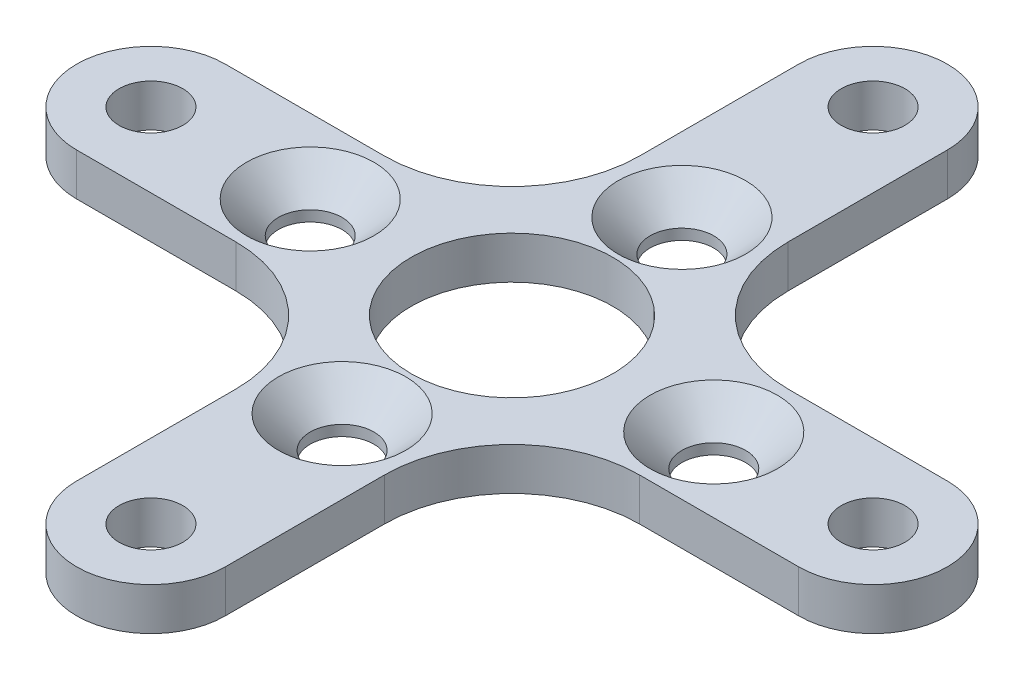
ISO-10303-21;
HEADER;
FILE_DESCRIPTION(('STEP AP214'),'2;1');
FILE_NAME('part.step','',(''),(''),'','','');
FILE_SCHEMA(('AUTOMOTIVE_DESIGN { 1 0 10303 214 1 1 1 1 }'));
ENDSEC;
DATA;
#1=APPLICATION_CONTEXT('core data for automotive mechanical design processes');
#2=APPLICATION_PROTOCOL_DEFINITION('international standard','automotive_design',2000,#1);
#3=PRODUCT_CONTEXT('',#1,'mechanical');
#4=PRODUCT('Part','Part','',(#3));
#5=PRODUCT_RELATED_PRODUCT_CATEGORY('part','',(#4));
#6=PRODUCT_DEFINITION_FORMATION('','',#4);
#7=PRODUCT_DEFINITION_CONTEXT('part definition',#1,'design');
#8=PRODUCT_DEFINITION('design','',#6,#7);
#9=PRODUCT_DEFINITION_SHAPE('','',#8);
#10=(LENGTH_UNIT() NAMED_UNIT(*) SI_UNIT(.MILLI.,.METRE.));
#11=(NAMED_UNIT(*) PLANE_ANGLE_UNIT() SI_UNIT($,.RADIAN.));
#12=(NAMED_UNIT(*) SI_UNIT($,.STERADIAN.) SOLID_ANGLE_UNIT());
#13=UNCERTAINTY_MEASURE_WITH_UNIT(LENGTH_MEASURE(1.E-05),#10,'distance_accuracy_value','');
#14=(GEOMETRIC_REPRESENTATION_CONTEXT(3) GLOBAL_UNCERTAINTY_ASSIGNED_CONTEXT((#13)) GLOBAL_UNIT_ASSIGNED_CONTEXT((#10,
#11,#12)) REPRESENTATION_CONTEXT('',''));
#15=CARTESIAN_POINT('',(0.,0.,0.));
#16=DIRECTION('',(0.,0.,1.));
#17=DIRECTION('',(1.,0.,0.));
#18=AXIS2_PLACEMENT_3D('',#15,#16,#17);
#19=CARTESIAN_POINT('',(0.,2.,17.));
#20=DIRECTION('',(0.,-1.,0.));
#21=DIRECTION('',(0.,0.,-1.));
#22=AXIS2_PLACEMENT_3D('',#19,#20,#21);
#23=PLANE('',#22);
#24=CARTESIAN_POINT('',(-9.5,2.,0.));
#25=DIRECTION('',(0.,-1.,0.));
#26=DIRECTION('',(0.,0.,-1.));
#27=AXIS2_PLACEMENT_3D('',#24,#25,#26);
#28=CIRCLE('',#27,3.);
#29=CARTESIAN_POINT('',(-9.5,2.,-3.));
#30=VERTEX_POINT('',#29);
#31=EDGE_CURVE('E272',#30,#30,#28,.T.);
#32=ORIENTED_EDGE('',*,*,#31,.T.);
#33=EDGE_LOOP('',(#32));
#34=FACE_BOUND('',#33,.T.);
#35=CARTESIAN_POINT('',(0.,2.,8.));
#36=DIRECTION('',(0.,-1.,0.));
#37=DIRECTION('',(0.,0.,-1.));
#38=AXIS2_PLACEMENT_3D('',#35,#36,#37);
#39=CIRCLE('',#38,3.00000000000001);
#40=CARTESIAN_POINT('',(0.,2.,4.99999999999999));
#41=VERTEX_POINT('',#40);
#42=EDGE_CURVE('E269',#41,#41,#39,.T.);
#43=ORIENTED_EDGE('',*,*,#42,.T.);
#44=EDGE_LOOP('',(#43));
#45=FACE_BOUND('',#44,.T.);
#46=CARTESIAN_POINT('',(9.5,2.,0.));
#47=DIRECTION('',(0.,-1.,0.));
#48=DIRECTION('',(0.,0.,-1.));
#49=AXIS2_PLACEMENT_3D('',#46,#47,#48);
#50=CIRCLE('',#49,3.00000000000002);
#51=CARTESIAN_POINT('',(9.5,2.,-3.00000000000002));
#52=VERTEX_POINT('',#51);
#53=EDGE_CURVE('E266',#52,#52,#50,.T.);
#54=ORIENTED_EDGE('',*,*,#53,.T.);
#55=EDGE_LOOP('',(#54));
#56=FACE_BOUND('',#55,.T.);
#57=CARTESIAN_POINT('',(0.,2.,-8.));
#58=DIRECTION('',(0.,-1.,0.));
#59=DIRECTION('',(0.,0.,-1.));
#60=AXIS2_PLACEMENT_3D('',#57,#58,#59);
#61=CIRCLE('',#60,3.);
#62=CARTESIAN_POINT('',(0.,2.,-11.));
#63=VERTEX_POINT('',#62);
#64=EDGE_CURVE('E263',#63,#63,#61,.T.);
#65=ORIENTED_EDGE('',*,*,#64,.T.);
#66=EDGE_LOOP('',(#65));
#67=FACE_BOUND('',#66,.T.);
#68=CARTESIAN_POINT('',(0.,2.,17.));
#69=DIRECTION('',(0.,1.,0.));
#70=DIRECTION('',(0.,0.,-1.));
#71=AXIS2_PLACEMENT_3D('',#68,#69,#70);
#72=CIRCLE('',#71,3.5);
#73=CARTESIAN_POINT('',(-3.5,2.,17.));
#74=VERTEX_POINT('',#73);
#75=CARTESIAN_POINT('',(3.5,2.,17.));
#76=VERTEX_POINT('',#75);
#77=EDGE_CURVE('E221',#74,#76,#72,.T.);
#78=ORIENTED_EDGE('',*,*,#77,.T.);
#79=DIRECTION('',(0.,0.,-1.));
#80=VECTOR('',#79,1.);
#81=CARTESIAN_POINT('',(3.5,2.,9.49999999999999));
#82=LINE('',#81,#80);
#83=CARTESIAN_POINT('',(3.5,2.,9.49999999999999));
#84=VERTEX_POINT('',#83);
#85=EDGE_CURVE('E129',#76,#84,#82,.T.);
#86=ORIENTED_EDGE('',*,*,#85,.T.);
#87=CARTESIAN_POINT('',(9.5,2.,9.49999999999999));
#88=DIRECTION('',(0.,-1.,0.));
#89=DIRECTION('',(0.,0.,1.));
#90=AXIS2_PLACEMENT_3D('',#87,#88,#89);
#91=CIRCLE('',#90,6.);
#92=CARTESIAN_POINT('',(9.5,2.,3.5));
#93=VERTEX_POINT('',#92);
#94=EDGE_CURVE('E440',#84,#93,#91,.T.);
#95=ORIENTED_EDGE('',*,*,#94,.T.);
#96=DIRECTION('',(1.,0.,0.));
#97=VECTOR('',#96,1.);
#98=CARTESIAN_POINT('',(17.,2.,3.49999999999999));
#99=LINE('',#98,#97);
#100=CARTESIAN_POINT('',(17.,2.,3.49999999999999));
#101=VERTEX_POINT('',#100);
#102=EDGE_CURVE('E442',#93,#101,#99,.T.);
#103=ORIENTED_EDGE('',*,*,#102,.T.);
#104=CARTESIAN_POINT('',(17.,2.,0.));
#105=DIRECTION('',(0.,1.,0.));
#106=DIRECTION('',(0.,0.,-1.));
#107=AXIS2_PLACEMENT_3D('',#104,#105,#106);
#108=CIRCLE('',#107,3.5);
#109=CARTESIAN_POINT('',(17.,2.,-3.5));
#110=VERTEX_POINT('',#109);
#111=EDGE_CURVE('E444',#101,#110,#108,.T.);
#112=ORIENTED_EDGE('',*,*,#111,.T.);
#113=DIRECTION('',(-1.,0.,0.));
#114=VECTOR('',#113,1.);
#115=CARTESIAN_POINT('',(17.,2.,-3.5));
#116=LINE('',#115,#114);
#117=CARTESIAN_POINT('',(9.5,2.,-3.5));
#118=VERTEX_POINT('',#117);
#119=EDGE_CURVE('E446',#110,#118,#116,.T.);
#120=ORIENTED_EDGE('',*,*,#119,.T.);
#121=CARTESIAN_POINT('',(9.5,2.,-9.5));
#122=DIRECTION('',(0.,-1.,0.));
#123=DIRECTION('',(0.,0.,-1.));
#124=AXIS2_PLACEMENT_3D('',#121,#122,#123);
#125=CIRCLE('',#124,6.);
#126=CARTESIAN_POINT('',(3.5,2.,-9.5));
#127=VERTEX_POINT('',#126);
#128=EDGE_CURVE('E448',#118,#127,#125,.T.);
#129=ORIENTED_EDGE('',*,*,#128,.T.);
#130=DIRECTION('',(0.,0.,-1.));
#131=VECTOR('',#130,1.);
#132=CARTESIAN_POINT('',(3.5,2.,-17.));
#133=LINE('',#132,#131);
#134=CARTESIAN_POINT('',(3.5,2.,-17.));
#135=VERTEX_POINT('',#134);
#136=EDGE_CURVE('E450',#127,#135,#133,.T.);
#137=ORIENTED_EDGE('',*,*,#136,.T.);
#138=CARTESIAN_POINT('',(0.,2.,-17.));
#139=DIRECTION('',(0.,1.,0.));
#140=DIRECTION('',(0.,0.,-1.));
#141=AXIS2_PLACEMENT_3D('',#138,#139,#140);
#142=CIRCLE('',#141,3.5);
#143=CARTESIAN_POINT('',(-3.50000000000001,2.,-17.));
#144=VERTEX_POINT('',#143);
#145=EDGE_CURVE('E452',#135,#144,#142,.T.);
#146=ORIENTED_EDGE('',*,*,#145,.T.);
#147=DIRECTION('',(0.,0.,1.));
#148=VECTOR('',#147,1.);
#149=CARTESIAN_POINT('',(-3.50000000000001,2.,-9.5));
#150=LINE('',#149,#148);
#151=CARTESIAN_POINT('',(-3.50000000000001,2.,-9.5));
#152=VERTEX_POINT('',#151);
#153=EDGE_CURVE('E454',#144,#152,#150,.T.);
#154=ORIENTED_EDGE('',*,*,#153,.T.);
#155=CARTESIAN_POINT('',(-9.5,2.,-9.5));
#156=DIRECTION('',(0.,-1.,0.));
#157=DIRECTION('',(0.,0.,1.));
#158=AXIS2_PLACEMENT_3D('',#155,#156,#157);
#159=CIRCLE('',#158,6.);
#160=CARTESIAN_POINT('',(-9.5,2.,-3.5));
#161=VERTEX_POINT('',#160);
#162=EDGE_CURVE('E456',#152,#161,#159,.T.);
#163=ORIENTED_EDGE('',*,*,#162,.T.);
#164=DIRECTION('',(-1.,0.,0.));
#165=VECTOR('',#164,1.);
#166=CARTESIAN_POINT('',(-17.,2.,-3.49999999999999));
#167=LINE('',#166,#165);
#168=CARTESIAN_POINT('',(-17.,2.,-3.49999999999999));
#169=VERTEX_POINT('',#168);
#170=EDGE_CURVE('E458',#161,#169,#167,.T.);
#171=ORIENTED_EDGE('',*,*,#170,.T.);
#172=CARTESIAN_POINT('',(-17.,2.,0.));
#173=DIRECTION('',(0.,1.,0.));
#174=DIRECTION('',(0.,0.,-1.));
#175=AXIS2_PLACEMENT_3D('',#172,#173,#174);
#176=CIRCLE('',#175,3.5);
#177=CARTESIAN_POINT('',(-17.,2.,3.5));
#178=VERTEX_POINT('',#177);
#179=EDGE_CURVE('E172',#169,#178,#176,.T.);
#180=ORIENTED_EDGE('',*,*,#179,.T.);
#181=DIRECTION('',(1.,0.,0.));
#182=VECTOR('',#181,1.);
#183=CARTESIAN_POINT('',(-9.5,2.,3.5));
#184=LINE('',#183,#182);
#185=CARTESIAN_POINT('',(-9.5,2.,3.5));
#186=VERTEX_POINT('',#185);
#187=EDGE_CURVE('E166',#178,#186,#184,.T.);
#188=ORIENTED_EDGE('',*,*,#187,.T.);
#189=CARTESIAN_POINT('',(-9.5,2.,9.5));
#190=DIRECTION('',(0.,-1.,0.));
#191=DIRECTION('',(0.,0.,1.));
#192=AXIS2_PLACEMENT_3D('',#189,#190,#191);
#193=CIRCLE('',#192,6.);
#194=CARTESIAN_POINT('',(-3.5,2.,9.5));
#195=VERTEX_POINT('',#194);
#196=EDGE_CURVE('E170',#186,#195,#193,.T.);
#197=ORIENTED_EDGE('',*,*,#196,.T.);
#198=DIRECTION('',(0.,0.,1.));
#199=VECTOR('',#198,1.);
#200=CARTESIAN_POINT('',(-3.5,2.,17.));
#201=LINE('',#200,#199);
#202=EDGE_CURVE('E61',#195,#74,#201,.T.);
#203=ORIENTED_EDGE('',*,*,#202,.T.);
#204=EDGE_LOOP('',(#78,#86,#95,#103,#112,#120,#129,#137,#146,#154,#163,#171,#180,#188,#197,#203));
#205=FACE_BOUND('',#204,.T.);
#206=CARTESIAN_POINT('',(0.,2.,0.));
#207=DIRECTION('',(0.,1.,0.));
#208=DIRECTION('',(0.,0.,1.));
#209=AXIS2_PLACEMENT_3D('',#206,#207,#208);
#210=CIRCLE('',#209,4.75);
#211=CARTESIAN_POINT('',(0.,2.,4.75));
#212=VERTEX_POINT('',#211);
#213=EDGE_CURVE('E194',#212,#212,#210,.T.);
#214=ORIENTED_EDGE('',*,*,#213,.F.);
#215=EDGE_LOOP('',(#214));
#216=FACE_BOUND('',#215,.T.);
#217=CARTESIAN_POINT('',(0.,2.,-17.));
#218=DIRECTION('',(0.,1.,0.));
#219=DIRECTION('',(0.,0.,1.));
#220=AXIS2_PLACEMENT_3D('',#217,#218,#219);
#221=CIRCLE('',#220,1.5);
#222=CARTESIAN_POINT('',(0.,2.,-15.5));
#223=VERTEX_POINT('',#222);
#224=EDGE_CURVE('E428',#223,#223,#221,.T.);
#225=ORIENTED_EDGE('',*,*,#224,.F.);
#226=EDGE_LOOP('',(#225));
#227=FACE_BOUND('',#226,.T.);
#228=CARTESIAN_POINT('',(17.,2.,0.));
#229=DIRECTION('',(0.,1.,0.));
#230=DIRECTION('',(0.,0.,1.));
#231=AXIS2_PLACEMENT_3D('',#228,#229,#230);
#232=CIRCLE('',#231,1.5);
#233=CARTESIAN_POINT('',(17.,2.,1.5));
#234=VERTEX_POINT('',#233);
#235=EDGE_CURVE('E419',#234,#234,#232,.T.);
#236=ORIENTED_EDGE('',*,*,#235,.F.);
#237=EDGE_LOOP('',(#236));
#238=FACE_BOUND('',#237,.T.);
#239=CARTESIAN_POINT('',(0.,2.,17.));
#240=DIRECTION('',(0.,1.,0.));
#241=DIRECTION('',(0.,0.,1.));
#242=AXIS2_PLACEMENT_3D('',#239,#240,#241);
#243=CIRCLE('',#242,1.5);
#244=CARTESIAN_POINT('',(0.,2.,18.5));
#245=VERTEX_POINT('',#244);
#246=EDGE_CURVE('E410',#245,#245,#243,.T.);
#247=ORIENTED_EDGE('',*,*,#246,.F.);
#248=EDGE_LOOP('',(#247));
#249=FACE_BOUND('',#248,.T.);
#250=CARTESIAN_POINT('',(-17.,2.,0.));
#251=DIRECTION('',(0.,1.,0.));
#252=DIRECTION('',(0.,0.,1.));
#253=AXIS2_PLACEMENT_3D('',#250,#251,#252);
#254=CIRCLE('',#253,1.5);
#255=CARTESIAN_POINT('',(-17.,2.,1.5));
#256=VERTEX_POINT('',#255);
#257=EDGE_CURVE('E401',#256,#256,#254,.T.);
#258=ORIENTED_EDGE('',*,*,#257,.F.);
#259=EDGE_LOOP('',(#258));
#260=FACE_BOUND('',#259,.T.);
#261=ADVANCED_FACE('F43',(#34,#45,#56,#67,#205,#216,#227,#238,#249,#260),#23,.F.);
#262=CARTESIAN_POINT('',(0.,0.,17.));
#263=DIRECTION('',(0.,-1.,0.));
#264=DIRECTION('',(0.,0.,-1.));
#265=AXIS2_PLACEMENT_3D('',#262,#263,#264);
#266=PLANE('',#265);
#267=CARTESIAN_POINT('',(-17.,0.,0.));
#268=DIRECTION('',(0.,1.,0.));
#269=DIRECTION('',(0.,0.,1.));
#270=AXIS2_PLACEMENT_3D('',#267,#268,#269);
#271=CIRCLE('',#270,1.5);
#272=CARTESIAN_POINT('',(-17.,0.,1.5));
#273=VERTEX_POINT('',#272);
#274=EDGE_CURVE('E398',#273,#273,#271,.T.);
#275=ORIENTED_EDGE('',*,*,#274,.T.);
#276=EDGE_LOOP('',(#275));
#277=FACE_BOUND('',#276,.T.);
#278=CARTESIAN_POINT('',(0.,0.,17.));
#279=DIRECTION('',(0.,1.,0.));
#280=DIRECTION('',(0.,0.,1.));
#281=AXIS2_PLACEMENT_3D('',#278,#279,#280);
#282=CIRCLE('',#281,1.5);
#283=CARTESIAN_POINT('',(0.,0.,18.5));
#284=VERTEX_POINT('',#283);
#285=EDGE_CURVE('E409',#284,#284,#282,.T.);
#286=ORIENTED_EDGE('',*,*,#285,.T.);
#287=EDGE_LOOP('',(#286));
#288=FACE_BOUND('',#287,.T.);
#289=CARTESIAN_POINT('',(17.,0.,0.));
#290=DIRECTION('',(0.,1.,0.));
#291=DIRECTION('',(0.,0.,1.));
#292=AXIS2_PLACEMENT_3D('',#289,#290,#291);
#293=CIRCLE('',#292,1.5);
#294=CARTESIAN_POINT('',(17.,0.,1.5));
#295=VERTEX_POINT('',#294);
#296=EDGE_CURVE('E418',#295,#295,#293,.T.);
#297=ORIENTED_EDGE('',*,*,#296,.T.);
#298=EDGE_LOOP('',(#297));
#299=FACE_BOUND('',#298,.T.);
#300=CARTESIAN_POINT('',(0.,0.,-17.));
#301=DIRECTION('',(0.,1.,0.));
#302=DIRECTION('',(0.,0.,1.));
#303=AXIS2_PLACEMENT_3D('',#300,#301,#302);
#304=CIRCLE('',#303,1.5);
#305=CARTESIAN_POINT('',(0.,0.,-15.5));
#306=VERTEX_POINT('',#305);
#307=EDGE_CURVE('E427',#306,#306,#304,.T.);
#308=ORIENTED_EDGE('',*,*,#307,.T.);
#309=EDGE_LOOP('',(#308));
#310=FACE_BOUND('',#309,.T.);
#311=CARTESIAN_POINT('',(0.,0.,17.));
#312=DIRECTION('',(0.,1.,0.));
#313=DIRECTION('',(0.,0.,-1.));
#314=AXIS2_PLACEMENT_3D('',#311,#312,#313);
#315=CIRCLE('',#314,3.5);
#316=CARTESIAN_POINT('',(-3.5,0.,17.));
#317=VERTEX_POINT('',#316);
#318=CARTESIAN_POINT('',(3.5,0.,17.));
#319=VERTEX_POINT('',#318);
#320=EDGE_CURVE('E190',#317,#319,#315,.T.);
#321=ORIENTED_EDGE('',*,*,#320,.F.);
#322=DIRECTION('',(0.,0.,1.));
#323=VECTOR('',#322,1.);
#324=CARTESIAN_POINT('',(-3.5,0.,17.));
#325=LINE('',#324,#323);
#326=CARTESIAN_POINT('',(-3.5,0.,9.5));
#327=VERTEX_POINT('',#326);
#328=EDGE_CURVE('E120',#327,#317,#325,.T.);
#329=ORIENTED_EDGE('',*,*,#328,.F.);
#330=CARTESIAN_POINT('',(-9.5,0.,9.5));
#331=DIRECTION('',(0.,-1.,0.));
#332=DIRECTION('',(0.,0.,1.));
#333=AXIS2_PLACEMENT_3D('',#330,#331,#332);
#334=CIRCLE('',#333,6.);
#335=CARTESIAN_POINT('',(-9.5,0.,3.5));
#336=VERTEX_POINT('',#335);
#337=EDGE_CURVE('E114',#336,#327,#334,.T.);
#338=ORIENTED_EDGE('',*,*,#337,.F.);
#339=DIRECTION('',(1.,0.,0.));
#340=VECTOR('',#339,1.);
#341=CARTESIAN_POINT('',(-9.5,0.,3.5));
#342=LINE('',#341,#340);
#343=CARTESIAN_POINT('',(-17.,0.,3.5));
#344=VERTEX_POINT('',#343);
#345=EDGE_CURVE('E180',#344,#336,#342,.T.);
#346=ORIENTED_EDGE('',*,*,#345,.F.);
#347=CARTESIAN_POINT('',(-17.,0.,0.));
#348=DIRECTION('',(0.,1.,0.));
#349=DIRECTION('',(0.,0.,-1.));
#350=AXIS2_PLACEMENT_3D('',#347,#348,#349);
#351=CIRCLE('',#350,3.5);
#352=CARTESIAN_POINT('',(-17.,0.,-3.49999999999999));
#353=VERTEX_POINT('',#352);
#354=EDGE_CURVE('E216',#353,#344,#351,.T.);
#355=ORIENTED_EDGE('',*,*,#354,.F.);
#356=DIRECTION('',(-1.,0.,0.));
#357=VECTOR('',#356,1.);
#358=CARTESIAN_POINT('',(-17.,0.,-3.49999999999999));
#359=LINE('',#358,#357);
#360=CARTESIAN_POINT('',(-9.5,0.,-3.5));
#361=VERTEX_POINT('',#360);
#362=EDGE_CURVE('E214',#361,#353,#359,.T.);
#363=ORIENTED_EDGE('',*,*,#362,.F.);
#364=CARTESIAN_POINT('',(-9.5,0.,-9.5));
#365=DIRECTION('',(0.,-1.,0.));
#366=DIRECTION('',(0.,0.,1.));
#367=AXIS2_PLACEMENT_3D('',#364,#365,#366);
#368=CIRCLE('',#367,6.);
#369=CARTESIAN_POINT('',(-3.50000000000001,0.,-9.5));
#370=VERTEX_POINT('',#369);
#371=EDGE_CURVE('E212',#370,#361,#368,.T.);
#372=ORIENTED_EDGE('',*,*,#371,.F.);
#373=DIRECTION('',(0.,0.,1.));
#374=VECTOR('',#373,1.);
#375=CARTESIAN_POINT('',(-3.50000000000001,0.,-9.5));
#376=LINE('',#375,#374);
#377=CARTESIAN_POINT('',(-3.50000000000001,0.,-17.));
#378=VERTEX_POINT('',#377);
#379=EDGE_CURVE('E210',#378,#370,#376,.T.);
#380=ORIENTED_EDGE('',*,*,#379,.F.);
#381=CARTESIAN_POINT('',(0.,0.,-17.));
#382=DIRECTION('',(0.,1.,0.));
#383=DIRECTION('',(0.,0.,-1.));
#384=AXIS2_PLACEMENT_3D('',#381,#382,#383);
#385=CIRCLE('',#384,3.5);
#386=CARTESIAN_POINT('',(3.5,0.,-17.));
#387=VERTEX_POINT('',#386);
#388=EDGE_CURVE('E208',#387,#378,#385,.T.);
#389=ORIENTED_EDGE('',*,*,#388,.F.);
#390=DIRECTION('',(0.,0.,-1.));
#391=VECTOR('',#390,1.);
#392=CARTESIAN_POINT('',(3.5,0.,-17.));
#393=LINE('',#392,#391);
#394=CARTESIAN_POINT('',(3.5,0.,-9.5));
#395=VERTEX_POINT('',#394);
#396=EDGE_CURVE('E206',#395,#387,#393,.T.);
#397=ORIENTED_EDGE('',*,*,#396,.F.);
#398=CARTESIAN_POINT('',(9.5,0.,-9.5));
#399=DIRECTION('',(0.,-1.,0.));
#400=DIRECTION('',(0.,0.,-1.));
#401=AXIS2_PLACEMENT_3D('',#398,#399,#400);
#402=CIRCLE('',#401,6.);
#403=CARTESIAN_POINT('',(9.5,0.,-3.5));
#404=VERTEX_POINT('',#403);
#405=EDGE_CURVE('E204',#404,#395,#402,.T.);
#406=ORIENTED_EDGE('',*,*,#405,.F.);
#407=DIRECTION('',(-1.,0.,0.));
#408=VECTOR('',#407,1.);
#409=CARTESIAN_POINT('',(17.,0.,-3.5));
#410=LINE('',#409,#408);
#411=CARTESIAN_POINT('',(17.,0.,-3.5));
#412=VERTEX_POINT('',#411);
#413=EDGE_CURVE('E202',#412,#404,#410,.T.);
#414=ORIENTED_EDGE('',*,*,#413,.F.);
#415=CARTESIAN_POINT('',(17.,0.,0.));
#416=DIRECTION('',(0.,1.,0.));
#417=DIRECTION('',(0.,0.,-1.));
#418=AXIS2_PLACEMENT_3D('',#415,#416,#417);
#419=CIRCLE('',#418,3.5);
#420=CARTESIAN_POINT('',(17.,0.,3.49999999999999));
#421=VERTEX_POINT('',#420);
#422=EDGE_CURVE('E200',#421,#412,#419,.T.);
#423=ORIENTED_EDGE('',*,*,#422,.F.);
#424=DIRECTION('',(1.,0.,0.));
#425=VECTOR('',#424,1.);
#426=CARTESIAN_POINT('',(17.,0.,3.49999999999999));
#427=LINE('',#426,#425);
#428=CARTESIAN_POINT('',(9.5,0.,3.5));
#429=VERTEX_POINT('',#428);
#430=EDGE_CURVE('E198',#429,#421,#427,.T.);
#431=ORIENTED_EDGE('',*,*,#430,.F.);
#432=CARTESIAN_POINT('',(9.5,0.,9.49999999999999));
#433=DIRECTION('',(0.,-1.,0.));
#434=DIRECTION('',(0.,0.,1.));
#435=AXIS2_PLACEMENT_3D('',#432,#433,#434);
#436=CIRCLE('',#435,6.);
#437=CARTESIAN_POINT('',(3.5,0.,9.49999999999999));
#438=VERTEX_POINT('',#437);
#439=EDGE_CURVE('E196',#438,#429,#436,.T.);
#440=ORIENTED_EDGE('',*,*,#439,.F.);
#441=DIRECTION('',(0.,0.,-1.));
#442=VECTOR('',#441,1.);
#443=CARTESIAN_POINT('',(3.5,0.,9.49999999999999));
#444=LINE('',#443,#442);
#445=EDGE_CURVE('E193',#319,#438,#444,.T.);
#446=ORIENTED_EDGE('',*,*,#445,.F.);
#447=EDGE_LOOP('',(#321,#329,#338,#346,#355,#363,#372,#380,#389,#397,#406,#414,#423,#431,#440,#446));
#448=FACE_BOUND('',#447,.T.);
#449=CARTESIAN_POINT('',(0.,0.,0.));
#450=DIRECTION('',(0.,1.,0.));
#451=DIRECTION('',(0.,0.,1.));
#452=AXIS2_PLACEMENT_3D('',#449,#450,#451);
#453=CIRCLE('',#452,4.75);
#454=CARTESIAN_POINT('',(0.,0.,4.75));
#455=VERTEX_POINT('',#454);
#456=EDGE_CURVE('E431',#455,#455,#453,.T.);
#457=ORIENTED_EDGE('',*,*,#456,.T.);
#458=EDGE_LOOP('',(#457));
#459=FACE_BOUND('',#458,.T.);
#460=CARTESIAN_POINT('',(0.,0.,-8.));
#461=DIRECTION('',(0.,1.,0.));
#462=DIRECTION('',(0.,0.,1.));
#463=AXIS2_PLACEMENT_3D('',#460,#461,#462);
#464=CIRCLE('',#463,1.5);
#465=CARTESIAN_POINT('',(0.,0.,-6.5));
#466=VERTEX_POINT('',#465);
#467=EDGE_CURVE('E422',#466,#466,#464,.T.);
#468=ORIENTED_EDGE('',*,*,#467,.T.);
#469=EDGE_LOOP('',(#468));
#470=FACE_BOUND('',#469,.T.);
#471=CARTESIAN_POINT('',(9.5,0.,0.));
#472=DIRECTION('',(0.,1.,0.));
#473=DIRECTION('',(0.,0.,1.));
#474=AXIS2_PLACEMENT_3D('',#471,#472,#473);
#475=CIRCLE('',#474,1.5);
#476=CARTESIAN_POINT('',(9.5,0.,1.5));
#477=VERTEX_POINT('',#476);
#478=EDGE_CURVE('E413',#477,#477,#475,.T.);
#479=ORIENTED_EDGE('',*,*,#478,.T.);
#480=EDGE_LOOP('',(#479));
#481=FACE_BOUND('',#480,.T.);
#482=CARTESIAN_POINT('',(0.,0.,8.));
#483=DIRECTION('',(0.,1.,0.));
#484=DIRECTION('',(0.,0.,1.));
#485=AXIS2_PLACEMENT_3D('',#482,#483,#484);
#486=CIRCLE('',#485,1.5);
#487=CARTESIAN_POINT('',(0.,0.,9.5));
#488=VERTEX_POINT('',#487);
#489=EDGE_CURVE('E405',#488,#488,#486,.T.);
#490=ORIENTED_EDGE('',*,*,#489,.T.);
#491=EDGE_LOOP('',(#490));
#492=FACE_BOUND('',#491,.T.);
#493=CARTESIAN_POINT('',(-9.5,0.,0.));
#494=DIRECTION('',(0.,1.,0.));
#495=DIRECTION('',(0.,0.,1.));
#496=AXIS2_PLACEMENT_3D('',#493,#494,#495);
#497=CIRCLE('',#496,1.5);
#498=CARTESIAN_POINT('',(-9.5,0.,1.5));
#499=VERTEX_POINT('',#498);
#500=EDGE_CURVE('E396',#499,#499,#497,.T.);
#501=ORIENTED_EDGE('',*,*,#500,.T.);
#502=EDGE_LOOP('',(#501));
#503=FACE_BOUND('',#502,.T.);
#504=ADVANCED_FACE('F298',(#277,#288,#299,#310,#448,#459,#470,#481,#492,#503),#266,.T.);
#505=CARTESIAN_POINT('',(0.,2.,17.));
#506=DIRECTION('',(0.,-1.,0.));
#507=DIRECTION('',(0.,0.,-1.));
#508=AXIS2_PLACEMENT_3D('',#505,#506,#507);
#509=CYLINDRICAL_SURFACE('',#508,3.5);
#510=ORIENTED_EDGE('',*,*,#320,.T.);
#511=DIRECTION('',(0.,-1.,0.));
#512=VECTOR('',#511,1.);
#513=CARTESIAN_POINT('',(3.5,2.,17.));
#514=LINE('',#513,#512);
#515=EDGE_CURVE('E258',#76,#319,#514,.T.);
#516=ORIENTED_EDGE('',*,*,#515,.F.);
#517=ORIENTED_EDGE('',*,*,#77,.F.);
#518=DIRECTION('',(0.,-1.,0.));
#519=VECTOR('',#518,1.);
#520=CARTESIAN_POINT('',(-3.5,2.,17.));
#521=LINE('',#520,#519);
#522=EDGE_CURVE('E186',#74,#317,#521,.T.);
#523=ORIENTED_EDGE('',*,*,#522,.T.);
#524=EDGE_LOOP('',(#510,#516,#517,#523));
#525=FACE_BOUND('',#524,.T.);
#526=ADVANCED_FACE('F306',(#525),#509,.T.);
#527=CARTESIAN_POINT('',(3.5,2.,9.49999999999999));
#528=DIRECTION('',(-1.,0.,0.));
#529=DIRECTION('',(0.,0.,1.));
#530=AXIS2_PLACEMENT_3D('',#527,#528,#529);
#531=PLANE('',#530);
#532=ORIENTED_EDGE('',*,*,#445,.T.);
#533=DIRECTION('',(0.,-1.,0.));
#534=VECTOR('',#533,1.);
#535=CARTESIAN_POINT('',(3.5,2.,9.49999999999999));
#536=LINE('',#535,#534);
#537=EDGE_CURVE('E255',#84,#438,#536,.T.);
#538=ORIENTED_EDGE('',*,*,#537,.F.);
#539=ORIENTED_EDGE('',*,*,#85,.F.);
#540=ORIENTED_EDGE('',*,*,#515,.T.);
#541=EDGE_LOOP('',(#532,#538,#539,#540));
#542=FACE_BOUND('',#541,.T.);
#543=ADVANCED_FACE('F364',(#542),#531,.F.);
#544=CARTESIAN_POINT('',(9.5,2.,9.49999999999999));
#545=DIRECTION('',(0.,-1.,0.));
#546=DIRECTION('',(0.,0.,-1.));
#547=AXIS2_PLACEMENT_3D('',#544,#545,#546);
#548=CYLINDRICAL_SURFACE('',#547,6.);
#549=ORIENTED_EDGE('',*,*,#439,.T.);
#550=DIRECTION('',(0.,-1.,0.));
#551=VECTOR('',#550,1.);
#552=CARTESIAN_POINT('',(9.5,2.,3.5));
#553=LINE('',#552,#551);
#554=EDGE_CURVE('E252',#93,#429,#553,.T.);
#555=ORIENTED_EDGE('',*,*,#554,.F.);
#556=ORIENTED_EDGE('',*,*,#94,.F.);
#557=ORIENTED_EDGE('',*,*,#537,.T.);
#558=EDGE_LOOP('',(#549,#555,#556,#557));
#559=FACE_BOUND('',#558,.T.);
#560=ADVANCED_FACE('F360',(#559),#548,.F.);
#561=CARTESIAN_POINT('',(17.,2.,3.49999999999999));
#562=DIRECTION('',(0.,0.,-1.));
#563=DIRECTION('',(-1.,0.,0.));
#564=AXIS2_PLACEMENT_3D('',#561,#562,#563);
#565=PLANE('',#564);
#566=ORIENTED_EDGE('',*,*,#430,.T.);
#567=DIRECTION('',(0.,-1.,0.));
#568=VECTOR('',#567,1.);
#569=CARTESIAN_POINT('',(17.,2.,3.49999999999999));
#570=LINE('',#569,#568);
#571=EDGE_CURVE('E249',#101,#421,#570,.T.);
#572=ORIENTED_EDGE('',*,*,#571,.F.);
#573=ORIENTED_EDGE('',*,*,#102,.F.);
#574=ORIENTED_EDGE('',*,*,#554,.T.);
#575=EDGE_LOOP('',(#566,#572,#573,#574));
#576=FACE_BOUND('',#575,.T.);
#577=ADVANCED_FACE('F356',(#576),#565,.F.);
#578=CARTESIAN_POINT('',(17.,2.,0.));
#579=DIRECTION('',(0.,-1.,0.));
#580=DIRECTION('',(0.,0.,-1.));
#581=AXIS2_PLACEMENT_3D('',#578,#579,#580);
#582=CYLINDRICAL_SURFACE('',#581,3.5);
#583=ORIENTED_EDGE('',*,*,#422,.T.);
#584=DIRECTION('',(0.,-1.,0.));
#585=VECTOR('',#584,1.);
#586=CARTESIAN_POINT('',(17.,2.,-3.5));
#587=LINE('',#586,#585);
#588=EDGE_CURVE('E246',#110,#412,#587,.T.);
#589=ORIENTED_EDGE('',*,*,#588,.F.);
#590=ORIENTED_EDGE('',*,*,#111,.F.);
#591=ORIENTED_EDGE('',*,*,#571,.T.);
#592=EDGE_LOOP('',(#583,#589,#590,#591));
#593=FACE_BOUND('',#592,.T.);
#594=ADVANCED_FACE('F352',(#593),#582,.T.);
#595=CARTESIAN_POINT('',(17.,2.,-3.5));
#596=DIRECTION('',(0.,0.,1.));
#597=DIRECTION('',(1.,0.,0.));
#598=AXIS2_PLACEMENT_3D('',#595,#596,#597);
#599=PLANE('',#598);
#600=ORIENTED_EDGE('',*,*,#413,.T.);
#601=DIRECTION('',(0.,-1.,0.));
#602=VECTOR('',#601,1.);
#603=CARTESIAN_POINT('',(9.5,2.,-3.5));
#604=LINE('',#603,#602);
#605=EDGE_CURVE('E243',#118,#404,#604,.T.);
#606=ORIENTED_EDGE('',*,*,#605,.F.);
#607=ORIENTED_EDGE('',*,*,#119,.F.);
#608=ORIENTED_EDGE('',*,*,#588,.T.);
#609=EDGE_LOOP('',(#600,#606,#607,#608));
#610=FACE_BOUND('',#609,.T.);
#611=ADVANCED_FACE('F348',(#610),#599,.F.);
#612=CARTESIAN_POINT('',(9.5,2.,-9.5));
#613=DIRECTION('',(0.,-1.,0.));
#614=DIRECTION('',(0.,0.,-1.));
#615=AXIS2_PLACEMENT_3D('',#612,#613,#614);
#616=CYLINDRICAL_SURFACE('',#615,6.);
#617=ORIENTED_EDGE('',*,*,#405,.T.);
#618=DIRECTION('',(0.,-1.,0.));
#619=VECTOR('',#618,1.);
#620=CARTESIAN_POINT('',(3.5,2.,-9.5));
#621=LINE('',#620,#619);
#622=EDGE_CURVE('E240',#127,#395,#621,.T.);
#623=ORIENTED_EDGE('',*,*,#622,.F.);
#624=ORIENTED_EDGE('',*,*,#128,.F.);
#625=ORIENTED_EDGE('',*,*,#605,.T.);
#626=EDGE_LOOP('',(#617,#623,#624,#625));
#627=FACE_BOUND('',#626,.T.);
#628=ADVANCED_FACE('F344',(#627),#616,.F.);
#629=CARTESIAN_POINT('',(3.5,2.,-17.));
#630=DIRECTION('',(-1.,0.,0.));
#631=DIRECTION('',(0.,0.,1.));
#632=AXIS2_PLACEMENT_3D('',#629,#630,#631);
#633=PLANE('',#632);
#634=ORIENTED_EDGE('',*,*,#396,.T.);
#635=DIRECTION('',(0.,-1.,0.));
#636=VECTOR('',#635,1.);
#637=CARTESIAN_POINT('',(3.5,2.,-17.));
#638=LINE('',#637,#636);
#639=EDGE_CURVE('E237',#135,#387,#638,.T.);
#640=ORIENTED_EDGE('',*,*,#639,.F.);
#641=ORIENTED_EDGE('',*,*,#136,.F.);
#642=ORIENTED_EDGE('',*,*,#622,.T.);
#643=EDGE_LOOP('',(#634,#640,#641,#642));
#644=FACE_BOUND('',#643,.T.);
#645=ADVANCED_FACE('F340',(#644),#633,.F.);
#646=CARTESIAN_POINT('',(0.,2.,-17.));
#647=DIRECTION('',(0.,-1.,0.));
#648=DIRECTION('',(0.,0.,-1.));
#649=AXIS2_PLACEMENT_3D('',#646,#647,#648);
#650=CYLINDRICAL_SURFACE('',#649,3.5);
#651=ORIENTED_EDGE('',*,*,#388,.T.);
#652=DIRECTION('',(0.,-1.,0.));
#653=VECTOR('',#652,1.);
#654=CARTESIAN_POINT('',(-3.50000000000001,2.,-17.));
#655=LINE('',#654,#653);
#656=EDGE_CURVE('E234',#144,#378,#655,.T.);
#657=ORIENTED_EDGE('',*,*,#656,.F.);
#658=ORIENTED_EDGE('',*,*,#145,.F.);
#659=ORIENTED_EDGE('',*,*,#639,.T.);
#660=EDGE_LOOP('',(#651,#657,#658,#659));
#661=FACE_BOUND('',#660,.T.);
#662=ADVANCED_FACE('F336',(#661),#650,.T.);
#663=CARTESIAN_POINT('',(-3.50000000000001,2.,-9.5));
#664=DIRECTION('',(1.,0.,0.));
#665=DIRECTION('',(0.,0.,-1.));
#666=AXIS2_PLACEMENT_3D('',#663,#664,#665);
#667=PLANE('',#666);
#668=ORIENTED_EDGE('',*,*,#379,.T.);
#669=DIRECTION('',(0.,-1.,0.));
#670=VECTOR('',#669,1.);
#671=CARTESIAN_POINT('',(-3.50000000000001,2.,-9.5));
#672=LINE('',#671,#670);
#673=EDGE_CURVE('E231',#152,#370,#672,.T.);
#674=ORIENTED_EDGE('',*,*,#673,.F.);
#675=ORIENTED_EDGE('',*,*,#153,.F.);
#676=ORIENTED_EDGE('',*,*,#656,.T.);
#677=EDGE_LOOP('',(#668,#674,#675,#676));
#678=FACE_BOUND('',#677,.T.);
#679=ADVANCED_FACE('F332',(#678),#667,.F.);
#680=CARTESIAN_POINT('',(-9.5,2.,-9.5));
#681=DIRECTION('',(0.,-1.,0.));
#682=DIRECTION('',(0.,0.,-1.));
#683=AXIS2_PLACEMENT_3D('',#680,#681,#682);
#684=CYLINDRICAL_SURFACE('',#683,6.);
#685=ORIENTED_EDGE('',*,*,#371,.T.);
#686=DIRECTION('',(0.,-1.,0.));
#687=VECTOR('',#686,1.);
#688=CARTESIAN_POINT('',(-9.5,2.,-3.5));
#689=LINE('',#688,#687);
#690=EDGE_CURVE('E228',#161,#361,#689,.T.);
#691=ORIENTED_EDGE('',*,*,#690,.F.);
#692=ORIENTED_EDGE('',*,*,#162,.F.);
#693=ORIENTED_EDGE('',*,*,#673,.T.);
#694=EDGE_LOOP('',(#685,#691,#692,#693));
#695=FACE_BOUND('',#694,.T.);
#696=ADVANCED_FACE('F328',(#695),#684,.F.);
#697=CARTESIAN_POINT('',(-17.,2.,-3.49999999999999));
#698=DIRECTION('',(0.,0.,1.));
#699=DIRECTION('',(1.,0.,0.));
#700=AXIS2_PLACEMENT_3D('',#697,#698,#699);
#701=PLANE('',#700);
#702=ORIENTED_EDGE('',*,*,#362,.T.);
#703=DIRECTION('',(0.,-1.,0.));
#704=VECTOR('',#703,1.);
#705=CARTESIAN_POINT('',(-17.,2.,-3.49999999999999));
#706=LINE('',#705,#704);
#707=EDGE_CURVE('E225',#169,#353,#706,.T.);
#708=ORIENTED_EDGE('',*,*,#707,.F.);
#709=ORIENTED_EDGE('',*,*,#170,.F.);
#710=ORIENTED_EDGE('',*,*,#690,.T.);
#711=EDGE_LOOP('',(#702,#708,#709,#710));
#712=FACE_BOUND('',#711,.T.);
#713=ADVANCED_FACE('F324',(#712),#701,.F.);
#714=CARTESIAN_POINT('',(-17.,2.,0.));
#715=DIRECTION('',(0.,-1.,0.));
#716=DIRECTION('',(0.,0.,-1.));
#717=AXIS2_PLACEMENT_3D('',#714,#715,#716);
#718=CYLINDRICAL_SURFACE('',#717,3.5);
#719=ORIENTED_EDGE('',*,*,#354,.T.);
#720=DIRECTION('',(0.,-1.,0.));
#721=VECTOR('',#720,1.);
#722=CARTESIAN_POINT('',(-17.,2.,3.5));
#723=LINE('',#722,#721);
#724=EDGE_CURVE('E181',#178,#344,#723,.T.);
#725=ORIENTED_EDGE('',*,*,#724,.F.);
#726=ORIENTED_EDGE('',*,*,#179,.F.);
#727=ORIENTED_EDGE('',*,*,#707,.T.);
#728=EDGE_LOOP('',(#719,#725,#726,#727));
#729=FACE_BOUND('',#728,.T.);
#730=ADVANCED_FACE('F321',(#729),#718,.T.);
#731=CARTESIAN_POINT('',(-9.5,2.,3.5));
#732=DIRECTION('',(0.,0.,-1.));
#733=DIRECTION('',(-1.,0.,0.));
#734=AXIS2_PLACEMENT_3D('',#731,#732,#733);
#735=PLANE('',#734);
#736=ORIENTED_EDGE('',*,*,#345,.T.);
#737=DIRECTION('',(0.,-1.,0.));
#738=VECTOR('',#737,1.);
#739=CARTESIAN_POINT('',(-9.5,2.,3.5));
#740=LINE('',#739,#738);
#741=EDGE_CURVE('E177',#186,#336,#740,.T.);
#742=ORIENTED_EDGE('',*,*,#741,.F.);
#743=ORIENTED_EDGE('',*,*,#187,.F.);
#744=ORIENTED_EDGE('',*,*,#724,.T.);
#745=EDGE_LOOP('',(#736,#742,#743,#744));
#746=FACE_BOUND('',#745,.T.);
#747=ADVANCED_FACE('F178',(#746),#735,.F.);
#748=CARTESIAN_POINT('',(-9.5,2.,9.5));
#749=DIRECTION('',(0.,-1.,0.));
#750=DIRECTION('',(0.,0.,-1.));
#751=AXIS2_PLACEMENT_3D('',#748,#749,#750);
#752=CYLINDRICAL_SURFACE('',#751,6.);
#753=ORIENTED_EDGE('',*,*,#337,.T.);
#754=DIRECTION('',(0.,-1.,0.));
#755=VECTOR('',#754,1.);
#756=CARTESIAN_POINT('',(-3.5,2.,9.5));
#757=LINE('',#756,#755);
#758=EDGE_CURVE('E182',#195,#327,#757,.T.);
#759=ORIENTED_EDGE('',*,*,#758,.F.);
#760=ORIENTED_EDGE('',*,*,#196,.F.);
#761=ORIENTED_EDGE('',*,*,#741,.T.);
#762=EDGE_LOOP('',(#753,#759,#760,#761));
#763=FACE_BOUND('',#762,.T.);
#764=ADVANCED_FACE('F184',(#763),#752,.F.);
#765=CARTESIAN_POINT('',(-3.5,2.,17.));
#766=DIRECTION('',(1.,0.,0.));
#767=DIRECTION('',(0.,0.,-1.));
#768=AXIS2_PLACEMENT_3D('',#765,#766,#767);
#769=PLANE('',#768);
#770=ORIENTED_EDGE('',*,*,#328,.T.);
#771=ORIENTED_EDGE('',*,*,#522,.F.);
#772=ORIENTED_EDGE('',*,*,#202,.F.);
#773=ORIENTED_EDGE('',*,*,#758,.T.);
#774=EDGE_LOOP('',(#770,#771,#772,#773));
#775=FACE_BOUND('',#774,.T.);
#776=ADVANCED_FACE('F314',(#775),#769,.F.);
#777=CARTESIAN_POINT('',(0.,2.,0.));
#778=DIRECTION('',(0.,-1.,0.));
#779=DIRECTION('',(0.,0.,-1.));
#780=AXIS2_PLACEMENT_3D('',#777,#778,#779);
#781=CYLINDRICAL_SURFACE('',#780,4.75);
#782=ORIENTED_EDGE('',*,*,#213,.T.);
#783=EDGE_LOOP('',(#782));
#784=FACE_BOUND('',#783,.T.);
#785=ORIENTED_EDGE('',*,*,#456,.F.);
#786=EDGE_LOOP('',(#785));
#787=FACE_BOUND('',#786,.T.);
#788=ADVANCED_FACE('F311',(#784,#787),#781,.F.);
#789=CARTESIAN_POINT('',(0.,2.,-17.));
#790=DIRECTION('',(0.,-1.,0.));
#791=DIRECTION('',(0.,0.,-1.));
#792=AXIS2_PLACEMENT_3D('',#789,#790,#791);
#793=CYLINDRICAL_SURFACE('',#792,1.5);
#794=ORIENTED_EDGE('',*,*,#224,.T.);
#795=EDGE_LOOP('',(#794));
#796=FACE_BOUND('',#795,.T.);
#797=ORIENTED_EDGE('',*,*,#307,.F.);
#798=EDGE_LOOP('',(#797));
#799=FACE_BOUND('',#798,.T.);
#800=ADVANCED_FACE('F523',(#796,#799),#793,.F.);
#801=CARTESIAN_POINT('',(0.,2.,-8.));
#802=DIRECTION('',(0.,-1.,0.));
#803=DIRECTION('',(0.,0.,-1.));
#804=AXIS2_PLACEMENT_3D('',#801,#802,#803);
#805=CYLINDRICAL_SURFACE('',#804,1.5);
#806=CARTESIAN_POINT('',(0.,0.500000000000013,-8.));
#807=DIRECTION('',(0.,-1.,0.));
#808=DIRECTION('',(0.,0.,-1.));
#809=AXIS2_PLACEMENT_3D('',#806,#807,#808);
#810=CIRCLE('',#809,1.5);
#811=CARTESIAN_POINT('',(0.,0.500000000000013,-9.5));
#812=VERTEX_POINT('',#811);
#813=EDGE_CURVE('E11',#812,#812,#810,.F.);
#814=ORIENTED_EDGE('',*,*,#813,.T.);
#815=EDGE_LOOP('',(#814));
#816=FACE_BOUND('',#815,.T.);
#817=ORIENTED_EDGE('',*,*,#467,.F.);
#818=EDGE_LOOP('',(#817));
#819=FACE_BOUND('',#818,.T.);
#820=ADVANCED_FACE('F521',(#816,#819),#805,.F.);
#821=CARTESIAN_POINT('',(17.,2.,0.));
#822=DIRECTION('',(0.,-1.,0.));
#823=DIRECTION('',(0.,0.,-1.));
#824=AXIS2_PLACEMENT_3D('',#821,#822,#823);
#825=CYLINDRICAL_SURFACE('',#824,1.5);
#826=ORIENTED_EDGE('',*,*,#235,.T.);
#827=EDGE_LOOP('',(#826));
#828=FACE_BOUND('',#827,.T.);
#829=ORIENTED_EDGE('',*,*,#296,.F.);
#830=EDGE_LOOP('',(#829));
#831=FACE_BOUND('',#830,.T.);
#832=ADVANCED_FACE('F518',(#828,#831),#825,.F.);
#833=CARTESIAN_POINT('',(9.5,2.,0.));
#834=DIRECTION('',(0.,-1.,0.));
#835=DIRECTION('',(0.,0.,-1.));
#836=AXIS2_PLACEMENT_3D('',#833,#834,#835);
#837=CYLINDRICAL_SURFACE('',#836,1.5);
#838=CARTESIAN_POINT('',(9.5,0.499999999999991,0.));
#839=DIRECTION('',(0.,-1.,0.));
#840=DIRECTION('',(0.,0.,-1.));
#841=AXIS2_PLACEMENT_3D('',#838,#839,#840);
#842=CIRCLE('',#841,1.5);
#843=CARTESIAN_POINT('',(9.5,0.499999999999991,-1.5));
#844=VERTEX_POINT('',#843);
#845=EDGE_CURVE('E53',#844,#844,#842,.F.);
#846=ORIENTED_EDGE('',*,*,#845,.T.);
#847=EDGE_LOOP('',(#846));
#848=FACE_BOUND('',#847,.T.);
#849=ORIENTED_EDGE('',*,*,#478,.F.);
#850=EDGE_LOOP('',(#849));
#851=FACE_BOUND('',#850,.T.);
#852=ADVANCED_FACE('F280',(#848,#851),#837,.F.);
#853=CARTESIAN_POINT('',(0.,2.,17.));
#854=DIRECTION('',(0.,-1.,0.));
#855=DIRECTION('',(0.,0.,-1.));
#856=AXIS2_PLACEMENT_3D('',#853,#854,#855);
#857=CYLINDRICAL_SURFACE('',#856,1.5);
#858=ORIENTED_EDGE('',*,*,#246,.T.);
#859=EDGE_LOOP('',(#858));
#860=FACE_BOUND('',#859,.T.);
#861=ORIENTED_EDGE('',*,*,#285,.F.);
#862=EDGE_LOOP('',(#861));
#863=FACE_BOUND('',#862,.T.);
#864=ADVANCED_FACE('F505',(#860,#863),#857,.F.);
#865=CARTESIAN_POINT('',(0.,2.,8.));
#866=DIRECTION('',(0.,-1.,0.));
#867=DIRECTION('',(0.,0.,-1.));
#868=AXIS2_PLACEMENT_3D('',#865,#866,#867);
#869=CYLINDRICAL_SURFACE('',#868,1.5);
#870=CARTESIAN_POINT('',(0.,0.499999999999999,8.));
#871=DIRECTION('',(0.,-1.,0.));
#872=DIRECTION('',(0.,0.,-1.));
#873=AXIS2_PLACEMENT_3D('',#870,#871,#872);
#874=CIRCLE('',#873,1.5);
#875=CARTESIAN_POINT('',(0.,0.499999999999999,6.5));
#876=VERTEX_POINT('',#875);
#877=EDGE_CURVE('E275',#876,#876,#874,.F.);
#878=ORIENTED_EDGE('',*,*,#877,.T.);
#879=EDGE_LOOP('',(#878));
#880=FACE_BOUND('',#879,.T.);
#881=ORIENTED_EDGE('',*,*,#489,.F.);
#882=EDGE_LOOP('',(#881));
#883=FACE_BOUND('',#882,.T.);
#884=ADVANCED_FACE('F503',(#880,#883),#869,.F.);
#885=CARTESIAN_POINT('',(-17.,2.,0.));
#886=DIRECTION('',(0.,-1.,0.));
#887=DIRECTION('',(0.,0.,-1.));
#888=AXIS2_PLACEMENT_3D('',#885,#886,#887);
#889=CYLINDRICAL_SURFACE('',#888,1.5);
#890=ORIENTED_EDGE('',*,*,#257,.T.);
#891=EDGE_LOOP('',(#890));
#892=FACE_BOUND('',#891,.T.);
#893=ORIENTED_EDGE('',*,*,#274,.F.);
#894=EDGE_LOOP('',(#893));
#895=FACE_BOUND('',#894,.T.);
#896=ADVANCED_FACE('F387',(#892,#895),#889,.F.);
#897=CARTESIAN_POINT('',(-9.5,2.,0.));
#898=DIRECTION('',(0.,-1.,0.));
#899=DIRECTION('',(0.,0.,-1.));
#900=AXIS2_PLACEMENT_3D('',#897,#898,#899);
#901=CYLINDRICAL_SURFACE('',#900,1.5);
#902=CARTESIAN_POINT('',(-9.5,0.500000000000012,0.));
#903=DIRECTION('',(0.,-1.,0.));
#904=DIRECTION('',(0.,0.,-1.));
#905=AXIS2_PLACEMENT_3D('',#902,#903,#904);
#906=CIRCLE('',#905,1.5);
#907=CARTESIAN_POINT('',(-9.5,0.500000000000012,-1.5));
#908=VERTEX_POINT('',#907);
#909=EDGE_CURVE('E260',#908,#908,#906,.F.);
#910=ORIENTED_EDGE('',*,*,#909,.T.);
#911=EDGE_LOOP('',(#910));
#912=FACE_BOUND('',#911,.T.);
#913=ORIENTED_EDGE('',*,*,#500,.F.);
#914=EDGE_LOOP('',(#913));
#915=FACE_BOUND('',#914,.T.);
#916=ADVANCED_FACE('F376',(#912,#915),#901,.F.);
#917=CARTESIAN_POINT('',(-9.5,0.500000000000012,0.));
#918=DIRECTION('',(0.,1.,0.));
#919=DIRECTION('',(0.,0.,1.));
#920=AXIS2_PLACEMENT_3D('',#917,#918,#919);
#921=CONICAL_SURFACE('',#920,1.5,0.785398163397451);
#922=ORIENTED_EDGE('',*,*,#31,.F.);
#923=EDGE_LOOP('',(#922));
#924=FACE_BOUND('',#923,.T.);
#925=ORIENTED_EDGE('',*,*,#909,.F.);
#926=EDGE_LOOP('',(#925));
#927=FACE_BOUND('',#926,.T.);
#928=ADVANCED_FACE('F292',(#924,#927),#921,.F.);
#929=CARTESIAN_POINT('',(0.,0.499999999999999,8.));
#930=DIRECTION('',(0.,1.,0.));
#931=DIRECTION('',(0.,0.,1.));
#932=AXIS2_PLACEMENT_3D('',#929,#930,#931);
#933=CONICAL_SURFACE('',#932,1.5,0.785398163397451);
#934=ORIENTED_EDGE('',*,*,#42,.F.);
#935=EDGE_LOOP('',(#934));
#936=FACE_BOUND('',#935,.T.);
#937=ORIENTED_EDGE('',*,*,#877,.F.);
#938=EDGE_LOOP('',(#937));
#939=FACE_BOUND('',#938,.T.);
#940=ADVANCED_FACE('F285',(#936,#939),#933,.F.);
#941=CARTESIAN_POINT('',(9.5,0.499999999999991,0.));
#942=DIRECTION('',(0.,1.,0.));
#943=DIRECTION('',(0.,0.,1.));
#944=AXIS2_PLACEMENT_3D('',#941,#942,#943);
#945=CONICAL_SURFACE('',#944,1.5,0.785398163397451);
#946=ORIENTED_EDGE('',*,*,#53,.F.);
#947=EDGE_LOOP('',(#946));
#948=FACE_BOUND('',#947,.T.);
#949=ORIENTED_EDGE('',*,*,#845,.F.);
#950=EDGE_LOOP('',(#949));
#951=FACE_BOUND('',#950,.T.);
#952=ADVANCED_FACE('F283',(#948,#951),#945,.F.);
#953=CARTESIAN_POINT('',(0.,0.500000000000013,-8.));
#954=DIRECTION('',(0.,1.,0.));
#955=DIRECTION('',(0.,0.,1.));
#956=AXIS2_PLACEMENT_3D('',#953,#954,#955);
#957=CONICAL_SURFACE('',#956,1.5,0.785398163397451);
#958=ORIENTED_EDGE('',*,*,#64,.F.);
#959=EDGE_LOOP('',(#958));
#960=FACE_BOUND('',#959,.T.);
#961=ORIENTED_EDGE('',*,*,#813,.F.);
#962=EDGE_LOOP('',(#961));
#963=FACE_BOUND('',#962,.T.);
#964=ADVANCED_FACE('F46',(#960,#963),#957,.F.);
#965=CLOSED_SHELL('',(#261,#504,#526,#543,#560,#577,#594,#611,#628,#645,#662,#679,#696,#713,
#730,#747,#764,#776,#788,#800,#820,#832,#852,#864,#884,#896,#916,#928,#940,#952,#964));
#966=MANIFOLD_SOLID_BREP('B2',#965);
#967=ADVANCED_BREP_SHAPE_REPRESENTATION('',(#18,#966),#14);
#968=SHAPE_DEFINITION_REPRESENTATION(#9,#967);
ENDSEC;
END-ISO-10303-21;
